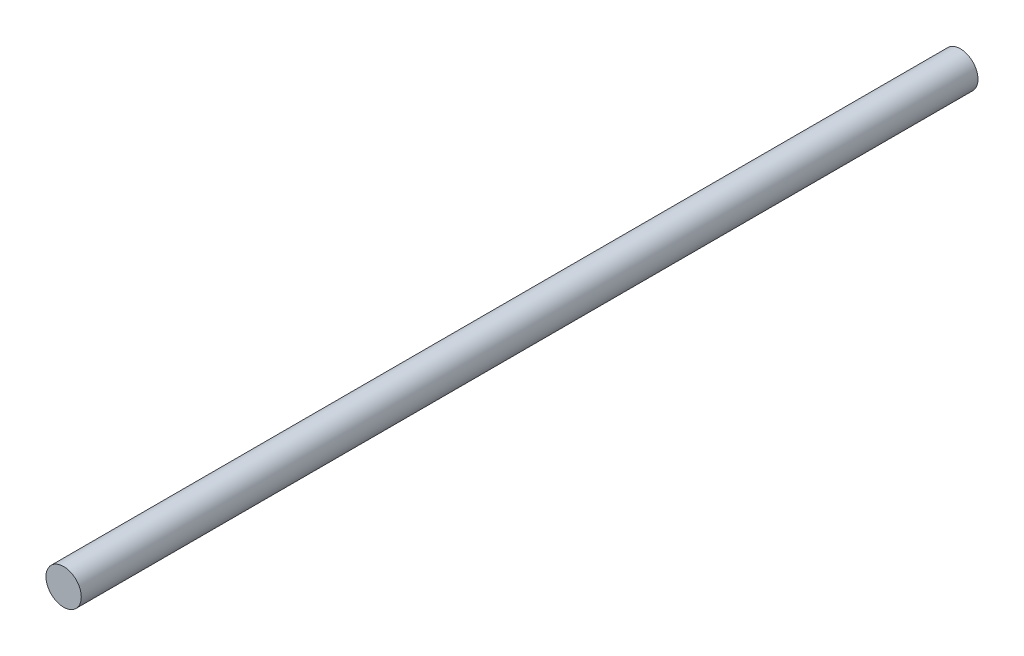
ISO-10303-21;
HEADER;
FILE_DESCRIPTION(('STEP AP214'),'2;1');
FILE_NAME('part.step','',(''),(''),'','','');
FILE_SCHEMA(('AUTOMOTIVE_DESIGN { 1 0 10303 214 1 1 1 1 }'));
ENDSEC;
DATA;
#1=APPLICATION_CONTEXT('core data for automotive mechanical design processes');
#2=APPLICATION_PROTOCOL_DEFINITION('international standard','automotive_design',2000,#1);
#3=PRODUCT_CONTEXT('',#1,'mechanical');
#4=PRODUCT('Part','Part','',(#3));
#5=PRODUCT_RELATED_PRODUCT_CATEGORY('part','',(#4));
#6=PRODUCT_DEFINITION_FORMATION('','',#4);
#7=PRODUCT_DEFINITION_CONTEXT('part definition',#1,'design');
#8=PRODUCT_DEFINITION('design','',#6,#7);
#9=PRODUCT_DEFINITION_SHAPE('','',#8);
#10=(LENGTH_UNIT() NAMED_UNIT(*) SI_UNIT(.MILLI.,.METRE.));
#11=(NAMED_UNIT(*) PLANE_ANGLE_UNIT() SI_UNIT($,.RADIAN.));
#12=(NAMED_UNIT(*) SI_UNIT($,.STERADIAN.) SOLID_ANGLE_UNIT());
#13=UNCERTAINTY_MEASURE_WITH_UNIT(LENGTH_MEASURE(1.E-05),#10,'distance_accuracy_value','');
#14=(GEOMETRIC_REPRESENTATION_CONTEXT(3) GLOBAL_UNCERTAINTY_ASSIGNED_CONTEXT((#13)) GLOBAL_UNIT_ASSIGNED_CONTEXT((#10,
#11,#12)) REPRESENTATION_CONTEXT('',''));
#15=CARTESIAN_POINT('',(0.,0.,0.));
#16=DIRECTION('',(0.,0.,1.));
#17=DIRECTION('',(1.,0.,0.));
#18=AXIS2_PLACEMENT_3D('',#15,#16,#17);
#19=CARTESIAN_POINT('',(0.,0.,322.58));
#20=DIRECTION('',(0.,0.,-1.));
#21=DIRECTION('',(-1.,0.,0.));
#22=AXIS2_PLACEMENT_3D('',#19,#20,#21);
#23=CYLINDRICAL_SURFACE('',#22,6.35);
#24=CARTESIAN_POINT('',(0.,0.,322.58));
#25=DIRECTION('',(0.,0.,1.));
#26=DIRECTION('',(1.,0.,0.));
#27=AXIS2_PLACEMENT_3D('',#24,#25,#26);
#28=CIRCLE('',#27,6.35);
#29=CARTESIAN_POINT('',(6.35,0.,322.58));
#30=VERTEX_POINT('',#29);
#31=EDGE_CURVE('E10',#30,#30,#28,.T.);
#32=ORIENTED_EDGE('',*,*,#31,.F.);
#33=EDGE_LOOP('',(#32));
#34=FACE_BOUND('',#33,.T.);
#35=CARTESIAN_POINT('',(0.,0.,0.));
#36=DIRECTION('',(0.,0.,1.));
#37=DIRECTION('',(1.,0.,0.));
#38=AXIS2_PLACEMENT_3D('',#35,#36,#37);
#39=CIRCLE('',#38,6.35);
#40=CARTESIAN_POINT('',(6.35,0.,0.));
#41=VERTEX_POINT('',#40);
#42=EDGE_CURVE('E40',#41,#41,#39,.T.);
#43=ORIENTED_EDGE('',*,*,#42,.T.);
#44=EDGE_LOOP('',(#43));
#45=FACE_BOUND('',#44,.T.);
#46=ADVANCED_FACE('F37',(#34,#45),#23,.T.);
#47=CARTESIAN_POINT('',(0.,0.,322.58));
#48=DIRECTION('',(0.,0.,1.));
#49=DIRECTION('',(1.,0.,0.));
#50=AXIS2_PLACEMENT_3D('',#47,#48,#49);
#51=PLANE('',#50);
#52=ORIENTED_EDGE('',*,*,#31,.T.);
#53=EDGE_LOOP('',(#52));
#54=FACE_BOUND('',#53,.T.);
#55=ADVANCED_FACE('F54',(#54),#51,.T.);
#56=CARTESIAN_POINT('',(0.,0.,0.));
#57=DIRECTION('',(0.,0.,1.));
#58=DIRECTION('',(1.,0.,0.));
#59=AXIS2_PLACEMENT_3D('',#56,#57,#58);
#60=PLANE('',#59);
#61=ORIENTED_EDGE('',*,*,#42,.F.);
#62=EDGE_LOOP('',(#61));
#63=FACE_BOUND('',#62,.T.);
#64=ADVANCED_FACE('F52',(#63),#60,.F.);
#65=CLOSED_SHELL('',(#46,#55,#64));
#66=MANIFOLD_SOLID_BREP('B2',#65);
#67=ADVANCED_BREP_SHAPE_REPRESENTATION('',(#18,#66),#14);
#68=SHAPE_DEFINITION_REPRESENTATION(#9,#67);
ENDSEC;
END-ISO-10303-21;
